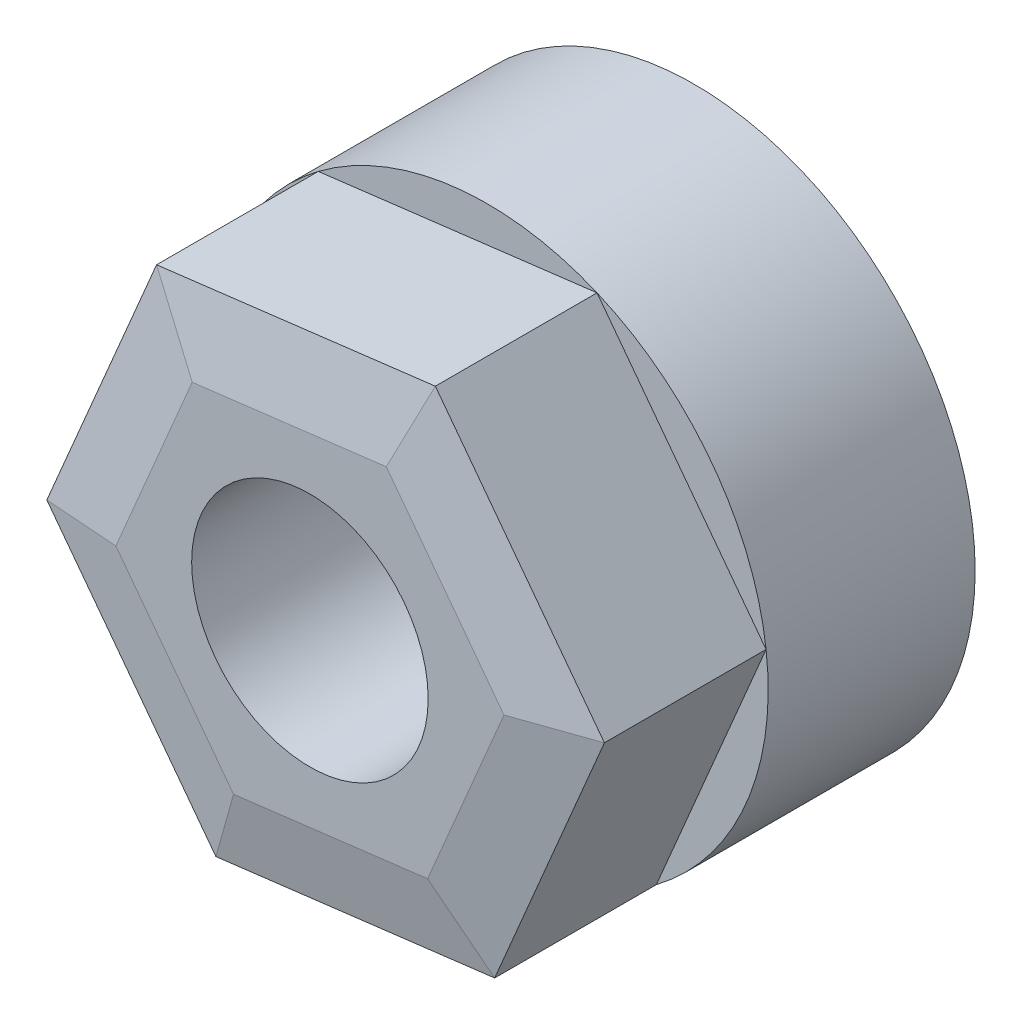
ISO-10303-21;
HEADER;
FILE_DESCRIPTION(('STEP AP214'),'2;1');
FILE_NAME('part.step','',(''),(''),'','','');
FILE_SCHEMA(('AUTOMOTIVE_DESIGN { 1 0 10303 214 1 1 1 1 }'));
ENDSEC;
DATA;
#1=APPLICATION_CONTEXT('core data for automotive mechanical design processes');
#2=APPLICATION_PROTOCOL_DEFINITION('international standard','automotive_design',2000,#1);
#3=PRODUCT_CONTEXT('',#1,'mechanical');
#4=PRODUCT('Part','Part','',(#3));
#5=PRODUCT_RELATED_PRODUCT_CATEGORY('part','',(#4));
#6=PRODUCT_DEFINITION_FORMATION('','',#4);
#7=PRODUCT_DEFINITION_CONTEXT('part definition',#1,'design');
#8=PRODUCT_DEFINITION('design','',#6,#7);
#9=PRODUCT_DEFINITION_SHAPE('','',#8);
#10=(LENGTH_UNIT() NAMED_UNIT(*) SI_UNIT(.MILLI.,.METRE.));
#11=(NAMED_UNIT(*) PLANE_ANGLE_UNIT() SI_UNIT($,.RADIAN.));
#12=(NAMED_UNIT(*) SI_UNIT($,.STERADIAN.) SOLID_ANGLE_UNIT());
#13=UNCERTAINTY_MEASURE_WITH_UNIT(LENGTH_MEASURE(1.E-05),#10,'distance_accuracy_value','');
#14=(GEOMETRIC_REPRESENTATION_CONTEXT(3) GLOBAL_UNCERTAINTY_ASSIGNED_CONTEXT((#13)) GLOBAL_UNIT_ASSIGNED_CONTEXT((#10,
#11,#12)) REPRESENTATION_CONTEXT('',''));
#15=CARTESIAN_POINT('',(0.,0.,0.));
#16=DIRECTION('',(0.,0.,1.));
#17=DIRECTION('',(1.,0.,0.));
#18=AXIS2_PLACEMENT_3D('',#15,#16,#17);
#19=CARTESIAN_POINT('',(0.,0.,7.));
#20=DIRECTION('',(0.,0.,1.));
#21=DIRECTION('',(1.,0.,0.));
#22=AXIS2_PLACEMENT_3D('',#19,#20,#21);
#23=PLANE('',#22);
#24=DIRECTION('',(-0.601855160906256,0.798605262498629,0.));
#25=VECTOR('',#24,1.);
#26=CARTESIAN_POINT('',(9.42913024104237,1.1582326611956,7.));
#27=LINE('',#26,#25);
#28=CARTESIAN_POINT('',(9.42913024104237,1.15823266119561,7.));
#29=VERTEX_POINT('',#28);
#30=CARTESIAN_POINT('',(3.71150621243294,8.74498265493258,7.));
#31=VERTEX_POINT('',#30);
#32=EDGE_CURVE('E143',#29,#31,#27,.T.);
#33=ORIENTED_EDGE('',*,*,#32,.F.);
#34=CARTESIAN_POINT('',(0.,0.,7.));
#35=DIRECTION('',(0.,0.,1.));
#36=DIRECTION('',(1.,0.,0.));
#37=AXIS2_PLACEMENT_3D('',#34,#35,#36);
#38=CIRCLE('',#37,9.5);
#39=EDGE_CURVE('E127',#29,#31,#38,.T.);
#40=ORIENTED_EDGE('',*,*,#39,.T.);
#41=EDGE_LOOP('',(#33,#40));
#42=FACE_BOUND('',#41,.T.);
#43=ADVANCED_FACE('F32',(#42),#23,.T.);
#44=DIRECTION('',(0.390684864466625,0.920524489992903,0.));
#45=VECTOR('',#44,1.);
#46=CARTESIAN_POINT('',(5.71762402860942,-7.58674999373698,7.));
#47=LINE('',#46,#45);
#48=CARTESIAN_POINT('',(5.71762402860942,-7.58674999373698,7.));
#49=VERTEX_POINT('',#48);
#50=EDGE_CURVE('E155',#49,#29,#47,.T.);
#51=ORIENTED_EDGE('',*,*,#50,.F.);
#52=EDGE_CURVE('E168',#49,#29,#38,.T.);
#53=ORIENTED_EDGE('',*,*,#52,.T.);
#54=EDGE_LOOP('',(#51,#53));
#55=FACE_BOUND('',#54,.T.);
#56=ADVANCED_FACE('F235',(#55),#23,.T.);
#57=DIRECTION('',(0.992540025372881,0.121919227494274,0.));
#58=VECTOR('',#57,1.);
#59=CARTESIAN_POINT('',(-3.71150621243293,-8.74498265493258,7.));
#60=LINE('',#59,#58);
#61=CARTESIAN_POINT('',(-3.71150621243293,-8.74498265493258,7.));
#62=VERTEX_POINT('',#61);
#63=EDGE_CURVE('E152',#62,#49,#60,.T.);
#64=ORIENTED_EDGE('',*,*,#63,.F.);
#65=EDGE_CURVE('E282',#62,#49,#38,.T.);
#66=ORIENTED_EDGE('',*,*,#65,.T.);
#67=EDGE_LOOP('',(#64,#66));
#68=FACE_BOUND('',#67,.T.);
#69=ADVANCED_FACE('F241',(#68),#23,.T.);
#70=DIRECTION('',(0.601855160906256,-0.798605262498629,0.));
#71=VECTOR('',#70,1.);
#72=CARTESIAN_POINT('',(-9.42913024104236,-1.1582326611956,7.));
#73=LINE('',#72,#71);
#74=CARTESIAN_POINT('',(-9.42913024104237,-1.15823266119562,7.));
#75=VERTEX_POINT('',#74);
#76=EDGE_CURVE('E139',#75,#62,#73,.T.);
#77=ORIENTED_EDGE('',*,*,#76,.F.);
#78=EDGE_CURVE('E136',#75,#62,#38,.T.);
#79=ORIENTED_EDGE('',*,*,#78,.T.);
#80=EDGE_LOOP('',(#77,#79));
#81=FACE_BOUND('',#80,.T.);
#82=ADVANCED_FACE('F254',(#81),#23,.T.);
#83=DIRECTION('',(-0.390684864466625,-0.920524489992903,0.));
#84=VECTOR('',#83,1.);
#85=CARTESIAN_POINT('',(-5.71762402860943,7.58674999373698,7.));
#86=LINE('',#85,#84);
#87=CARTESIAN_POINT('',(-5.71762402860943,7.58674999373698,7.));
#88=VERTEX_POINT('',#87);
#89=EDGE_CURVE('E108',#88,#75,#86,.T.);
#90=ORIENTED_EDGE('',*,*,#89,.F.);
#91=EDGE_CURVE('E128',#88,#75,#38,.T.);
#92=ORIENTED_EDGE('',*,*,#91,.T.);
#93=EDGE_LOOP('',(#90,#92));
#94=FACE_BOUND('',#93,.T.);
#95=ADVANCED_FACE('F138',(#94),#23,.T.);
#96=CARTESIAN_POINT('',(0.,0.,7.));
#97=DIRECTION('',(0.,0.,-1.));
#98=DIRECTION('',(-1.,0.,0.));
#99=AXIS2_PLACEMENT_3D('',#96,#97,#98);
#100=CYLINDRICAL_SURFACE('',#99,9.5);
#101=ORIENTED_EDGE('',*,*,#39,.F.);
#102=ORIENTED_EDGE('',*,*,#52,.F.);
#103=ORIENTED_EDGE('',*,*,#65,.F.);
#104=ORIENTED_EDGE('',*,*,#78,.F.);
#105=ORIENTED_EDGE('',*,*,#91,.F.);
#106=EDGE_CURVE('E120',#31,#88,#38,.T.);
#107=ORIENTED_EDGE('',*,*,#106,.F.);
#108=EDGE_LOOP('',(#101,#102,#103,#104,#105,#107));
#109=FACE_BOUND('',#108,.T.);
#110=CARTESIAN_POINT('',(0.,0.,0.));
#111=DIRECTION('',(0.,0.,1.));
#112=DIRECTION('',(1.,0.,0.));
#113=AXIS2_PLACEMENT_3D('',#110,#111,#112);
#114=CIRCLE('',#113,9.5);
#115=CARTESIAN_POINT('',(9.5,0.,0.));
#116=VERTEX_POINT('',#115);
#117=EDGE_CURVE('E165',#116,#116,#114,.T.);
#118=ORIENTED_EDGE('',*,*,#117,.T.);
#119=EDGE_LOOP('',(#118));
#120=FACE_BOUND('',#119,.T.);
#121=ADVANCED_FACE('F132',(#109,#120),#100,.T.);
#122=DIRECTION('',(-0.992540025372881,-0.121919227494274,0.));
#123=VECTOR('',#122,1.);
#124=CARTESIAN_POINT('',(3.71150621243294,8.74498265493258,7.));
#125=LINE('',#124,#123);
#126=EDGE_CURVE('E123',#31,#88,#125,.T.);
#127=ORIENTED_EDGE('',*,*,#126,.F.);
#128=ORIENTED_EDGE('',*,*,#106,.T.);
#129=EDGE_LOOP('',(#127,#128));
#130=FACE_BOUND('',#129,.T.);
#131=ADVANCED_FACE('F122',(#130),#23,.T.);
#132=CARTESIAN_POINT('',(0.,0.,0.));
#133=DIRECTION('',(0.,0.,1.));
#134=DIRECTION('',(1.,0.,0.));
#135=AXIS2_PLACEMENT_3D('',#132,#133,#134);
#136=PLANE('',#135);
#137=CARTESIAN_POINT('',(0.,0.,0.));
#138=DIRECTION('',(0.,0.,1.));
#139=DIRECTION('',(1.,0.,0.));
#140=AXIS2_PLACEMENT_3D('',#137,#138,#139);
#141=CIRCLE('',#140,4.);
#142=CARTESIAN_POINT('',(4.,0.,0.));
#143=VERTEX_POINT('',#142);
#144=EDGE_CURVE('E146',#143,#143,#141,.T.);
#145=ORIENTED_EDGE('',*,*,#144,.T.);
#146=EDGE_LOOP('',(#145));
#147=FACE_BOUND('',#146,.T.);
#148=ORIENTED_EDGE('',*,*,#117,.F.);
#149=EDGE_LOOP('',(#148));
#150=FACE_BOUND('',#149,.T.);
#151=ADVANCED_FACE('F218',(#147,#150),#136,.F.);
#152=CARTESIAN_POINT('',(9.42913024104237,1.1582326611956,13.));
#153=DIRECTION('',(-0.798605262498629,-0.601855160906256,0.));
#154=DIRECTION('',(0.601855160906256,-0.79860526249863,0.));
#155=AXIS2_PLACEMENT_3D('',#152,#153,#154);
#156=PLANE('',#155);
#157=DIRECTION('',(0.,0.,-1.));
#158=VECTOR('',#157,1.);
#159=CARTESIAN_POINT('',(3.71150621243294,8.74498265493258,13.));
#160=LINE('',#159,#158);
#161=CARTESIAN_POINT('',(3.71150621243294,8.74498265493258,12.4686085958249));
#162=VERTEX_POINT('',#161);
#163=EDGE_CURVE('E114',#162,#31,#160,.T.);
#164=ORIENTED_EDGE('',*,*,#163,.F.);
#165=DIRECTION('',(0.601855160906256,-0.79860526249863,0.));
#166=VECTOR('',#165,1.);
#167=CARTESIAN_POINT('',(9.42913024104237,1.1582326611956,12.4686085958249));
#168=LINE('',#167,#166);
#169=CARTESIAN_POINT('',(9.42913024104237,1.1582326611956,12.4686085958249));
#170=VERTEX_POINT('',#169);
#171=EDGE_CURVE('E185',#162,#170,#168,.T.);
#172=ORIENTED_EDGE('',*,*,#171,.T.);
#173=DIRECTION('',(0.,0.,-1.));
#174=VECTOR('',#173,1.);
#175=CARTESIAN_POINT('',(9.42913024104237,1.1582326611956,13.));
#176=LINE('',#175,#174);
#177=EDGE_CURVE('E158',#170,#29,#176,.T.);
#178=ORIENTED_EDGE('',*,*,#177,.T.);
#179=ORIENTED_EDGE('',*,*,#32,.T.);
#180=EDGE_LOOP('',(#164,#172,#178,#179));
#181=FACE_BOUND('',#180,.T.);
#182=ADVANCED_FACE('F251',(#181),#156,.F.);
#183=CARTESIAN_POINT('',(3.71150621243294,8.74498265493258,13.));
#184=DIRECTION('',(0.121919227494274,-0.992540025372881,0.));
#185=DIRECTION('',(0.992540025372881,0.121919227494274,0.));
#186=AXIS2_PLACEMENT_3D('',#183,#184,#185);
#187=PLANE('',#186);
#188=DIRECTION('',(0.,0.,-1.));
#189=VECTOR('',#188,1.);
#190=CARTESIAN_POINT('',(-5.71762402860943,7.58674999373698,13.));
#191=LINE('',#190,#189);
#192=CARTESIAN_POINT('',(-5.71762402860943,7.58674999373698,12.4686085958249));
#193=VERTEX_POINT('',#192);
#194=EDGE_CURVE('E104',#193,#88,#191,.T.);
#195=ORIENTED_EDGE('',*,*,#194,.F.);
#196=DIRECTION('',(0.992540025372881,0.121919227494274,0.));
#197=VECTOR('',#196,1.);
#198=CARTESIAN_POINT('',(3.71150621243294,8.74498265493258,12.4686085958249));
#199=LINE('',#198,#197);
#200=EDGE_CURVE('E183',#193,#162,#199,.T.);
#201=ORIENTED_EDGE('',*,*,#200,.T.);
#202=ORIENTED_EDGE('',*,*,#163,.T.);
#203=ORIENTED_EDGE('',*,*,#126,.T.);
#204=EDGE_LOOP('',(#195,#201,#202,#203));
#205=FACE_BOUND('',#204,.T.);
#206=ADVANCED_FACE('F141',(#205),#187,.F.);
#207=CARTESIAN_POINT('',(-5.71762402860943,7.58674999373698,13.));
#208=DIRECTION('',(0.920524489992903,-0.390684864466625,0.));
#209=DIRECTION('',(0.390684864466625,0.920524489992904,0.));
#210=AXIS2_PLACEMENT_3D('',#207,#208,#209);
#211=PLANE('',#210);
#212=DIRECTION('',(0.,0.,-1.));
#213=VECTOR('',#212,1.);
#214=CARTESIAN_POINT('',(-9.42913024104236,-1.1582326611956,13.));
#215=LINE('',#214,#213);
#216=CARTESIAN_POINT('',(-9.42913024104236,-1.1582326611956,12.4686085958249));
#217=VERTEX_POINT('',#216);
#218=EDGE_CURVE('E115',#217,#75,#215,.T.);
#219=ORIENTED_EDGE('',*,*,#218,.F.);
#220=DIRECTION('',(0.390684864466625,0.920524489992904,0.));
#221=VECTOR('',#220,1.);
#222=CARTESIAN_POINT('',(-5.71762402860943,7.58674999373698,12.4686085958249));
#223=LINE('',#222,#221);
#224=EDGE_CURVE('E11',#217,#193,#223,.T.);
#225=ORIENTED_EDGE('',*,*,#224,.T.);
#226=ORIENTED_EDGE('',*,*,#194,.T.);
#227=ORIENTED_EDGE('',*,*,#89,.T.);
#228=EDGE_LOOP('',(#219,#225,#226,#227));
#229=FACE_BOUND('',#228,.T.);
#230=ADVANCED_FACE('F106',(#229),#211,.F.);
#231=CARTESIAN_POINT('',(-9.42913024104236,-1.1582326611956,13.));
#232=DIRECTION('',(0.798605262498629,0.601855160906256,0.));
#233=DIRECTION('',(-0.601855160906256,0.79860526249863,0.));
#234=AXIS2_PLACEMENT_3D('',#231,#232,#233);
#235=PLANE('',#234);
#236=DIRECTION('',(0.,0.,-1.));
#237=VECTOR('',#236,1.);
#238=CARTESIAN_POINT('',(-3.71150621243293,-8.74498265493258,13.));
#239=LINE('',#238,#237);
#240=CARTESIAN_POINT('',(-3.71150621243293,-8.74498265493258,12.4686085958249));
#241=VERTEX_POINT('',#240);
#242=EDGE_CURVE('E162',#241,#62,#239,.T.);
#243=ORIENTED_EDGE('',*,*,#242,.F.);
#244=DIRECTION('',(-0.601855160906256,0.79860526249863,0.));
#245=VECTOR('',#244,1.);
#246=CARTESIAN_POINT('',(-9.42913024104236,-1.1582326611956,12.4686085958249));
#247=LINE('',#246,#245);
#248=EDGE_CURVE('E41',#241,#217,#247,.T.);
#249=ORIENTED_EDGE('',*,*,#248,.T.);
#250=ORIENTED_EDGE('',*,*,#218,.T.);
#251=ORIENTED_EDGE('',*,*,#76,.T.);
#252=EDGE_LOOP('',(#243,#249,#250,#251));
#253=FACE_BOUND('',#252,.T.);
#254=ADVANCED_FACE('F264',(#253),#235,.F.);
#255=CARTESIAN_POINT('',(-3.71150621243293,-8.74498265493258,13.));
#256=DIRECTION('',(-0.121919227494274,0.992540025372881,0.));
#257=DIRECTION('',(-0.992540025372881,-0.121919227494274,0.));
#258=AXIS2_PLACEMENT_3D('',#255,#256,#257);
#259=PLANE('',#258);
#260=DIRECTION('',(0.,0.,-1.));
#261=VECTOR('',#260,1.);
#262=CARTESIAN_POINT('',(5.71762402860942,-7.58674999373698,13.));
#263=LINE('',#262,#261);
#264=CARTESIAN_POINT('',(5.71762402860942,-7.58674999373698,12.4686085958249));
#265=VERTEX_POINT('',#264);
#266=EDGE_CURVE('E160',#265,#49,#263,.T.);
#267=ORIENTED_EDGE('',*,*,#266,.F.);
#268=DIRECTION('',(-0.992540025372881,-0.121919227494274,0.));
#269=VECTOR('',#268,1.);
#270=CARTESIAN_POINT('',(-3.71150621243293,-8.74498265493258,12.4686085958249));
#271=LINE('',#270,#269);
#272=EDGE_CURVE('E56',#265,#241,#271,.T.);
#273=ORIENTED_EDGE('',*,*,#272,.T.);
#274=ORIENTED_EDGE('',*,*,#242,.T.);
#275=ORIENTED_EDGE('',*,*,#63,.T.);
#276=EDGE_LOOP('',(#267,#273,#274,#275));
#277=FACE_BOUND('',#276,.T.);
#278=ADVANCED_FACE('F284',(#277),#259,.F.);
#279=CARTESIAN_POINT('',(5.71762402860942,-7.58674999373698,13.));
#280=DIRECTION('',(-0.920524489992903,0.390684864466625,0.));
#281=DIRECTION('',(-0.390684864466626,-0.920524489992903,0.));
#282=AXIS2_PLACEMENT_3D('',#279,#280,#281);
#283=PLANE('',#282);
#284=ORIENTED_EDGE('',*,*,#177,.F.);
#285=DIRECTION('',(-0.390684864466626,-0.920524489992903,0.));
#286=VECTOR('',#285,1.);
#287=CARTESIAN_POINT('',(5.71762402860942,-7.58674999373698,12.4686085958249));
#288=LINE('',#287,#286);
#289=EDGE_CURVE('E187',#170,#265,#288,.T.);
#290=ORIENTED_EDGE('',*,*,#289,.T.);
#291=ORIENTED_EDGE('',*,*,#266,.T.);
#292=ORIENTED_EDGE('',*,*,#50,.T.);
#293=EDGE_LOOP('',(#284,#290,#291,#292));
#294=FACE_BOUND('',#293,.T.);
#295=ADVANCED_FACE('F231',(#294),#283,.F.);
#296=CARTESIAN_POINT('',(0.,0.,13.));
#297=DIRECTION('',(0.,0.,1.));
#298=DIRECTION('',(1.,0.,0.));
#299=AXIS2_PLACEMENT_3D('',#296,#297,#298);
#300=PLANE('',#299);
#301=DIRECTION('',(-0.601855160906256,0.798605262498629,0.));
#302=VECTOR('',#301,1.);
#303=CARTESIAN_POINT('',(1.71499305618633,7.24034475266691,13.));
#304=LINE('',#303,#302);
#305=CARTESIAN_POINT('',(6.56391398688976,0.806282167129544,13.));
#306=VERTEX_POINT('',#305);
#307=CARTESIAN_POINT('',(2.58369615409232,6.0876573444673,13.));
#308=VERTEX_POINT('',#307);
#309=EDGE_CURVE('E178',#306,#308,#304,.T.);
#310=ORIENTED_EDGE('',*,*,#309,.T.);
#311=DIRECTION('',(-0.992540025372881,-0.121919227494274,0.));
#312=VECTOR('',#311,1.);
#313=CARTESIAN_POINT('',(-5.41282595987374,5.10539993030473,13.));
#314=LINE('',#313,#312);
#315=CARTESIAN_POINT('',(-3.98021783279743,5.28137517733776,13.));
#316=VERTEX_POINT('',#315);
#317=EDGE_CURVE('E180',#308,#316,#314,.T.);
#318=ORIENTED_EDGE('',*,*,#317,.T.);
#319=DIRECTION('',(-0.390684864466625,-0.920524489992903,0.));
#320=VECTOR('',#319,1.);
#321=CARTESIAN_POINT('',(-7.12781901606006,-2.13494482236218,13.));
#322=LINE('',#321,#320);
#323=CARTESIAN_POINT('',(-6.56391398688975,-0.806282167129545,13.));
#324=VERTEX_POINT('',#323);
#325=EDGE_CURVE('E167',#316,#324,#322,.T.);
#326=ORIENTED_EDGE('',*,*,#325,.T.);
#327=DIRECTION('',(0.601855160906256,-0.798605262498629,0.));
#328=VECTOR('',#327,1.);
#329=CARTESIAN_POINT('',(-1.71499305618632,-7.24034475266691,13.));
#330=LINE('',#329,#328);
#331=CARTESIAN_POINT('',(-2.58369615409232,-6.0876573444673,13.));
#332=VERTEX_POINT('',#331);
#333=EDGE_CURVE('E172',#324,#332,#330,.T.);
#334=ORIENTED_EDGE('',*,*,#333,.T.);
#335=DIRECTION('',(0.992540025372881,0.121919227494274,0.));
#336=VECTOR('',#335,1.);
#337=CARTESIAN_POINT('',(5.41282595987373,-5.10539993030473,13.));
#338=LINE('',#337,#336);
#339=CARTESIAN_POINT('',(3.98021783279743,-5.28137517733776,13.));
#340=VERTEX_POINT('',#339);
#341=EDGE_CURVE('E174',#332,#340,#338,.T.);
#342=ORIENTED_EDGE('',*,*,#341,.T.);
#343=DIRECTION('',(0.390684864466626,0.920524489992903,0.));
#344=VECTOR('',#343,1.);
#345=CARTESIAN_POINT('',(7.12781901606006,2.13494482236218,13.));
#346=LINE('',#345,#344);
#347=EDGE_CURVE('E176',#340,#306,#346,.T.);
#348=ORIENTED_EDGE('',*,*,#347,.T.);
#349=EDGE_LOOP('',(#310,#318,#326,#334,#342,#348));
#350=FACE_BOUND('',#349,.T.);
#351=CARTESIAN_POINT('',(0.,0.,13.));
#352=DIRECTION('',(0.,0.,1.));
#353=DIRECTION('',(1.,0.,0.));
#354=AXIS2_PLACEMENT_3D('',#351,#352,#353);
#355=CIRCLE('',#354,4.);
#356=CARTESIAN_POINT('',(4.,0.,13.));
#357=VERTEX_POINT('',#356);
#358=EDGE_CURVE('E206',#357,#357,#355,.T.);
#359=ORIENTED_EDGE('',*,*,#358,.F.);
#360=EDGE_LOOP('',(#359));
#361=FACE_BOUND('',#360,.T.);
#362=ADVANCED_FACE('F223',(#350,#361),#300,.T.);
#363=CARTESIAN_POINT('',(0.,0.,0.));
#364=DIRECTION('',(0.,0.,1.));
#365=DIRECTION('',(1.,0.,0.));
#366=AXIS2_PLACEMENT_3D('',#363,#364,#365);
#367=CYLINDRICAL_SURFACE('',#366,4.);
#368=ORIENTED_EDGE('',*,*,#144,.F.);
#369=EDGE_LOOP('',(#368));
#370=FACE_BOUND('',#369,.T.);
#371=ORIENTED_EDGE('',*,*,#358,.T.);
#372=EDGE_LOOP('',(#371));
#373=FACE_BOUND('',#372,.T.);
#374=ADVANCED_FACE('F221',(#370,#373),#367,.F.);
#375=CARTESIAN_POINT('',(0.698260839352554,-5.68451626090253,13.));
#376=DIRECTION('',(0.0253484327315291,-0.206360674879574,0.978147600733806));
#377=DIRECTION('',(-0.992540025372881,-0.121919227494274,0.));
#378=AXIS2_PLACEMENT_3D('',#375,#376,#377);
#379=PLANE('',#378);
#380=DIRECTION('',(0.384229250222659,0.90531389047907,0.181037683864391));
#381=VECTOR('',#380,1.);
#382=CARTESIAN_POINT('',(-1.95894204532337,-4.6156232073613,13.2943660243741));
#383=LINE('',#382,#381);
#384=EDGE_CURVE('E200',#241,#332,#383,.T.);
#385=ORIENTED_EDGE('',*,*,#384,.F.);
#386=ORIENTED_EDGE('',*,*,#272,.F.);
#387=DIRECTION('',(-0.591910202442468,0.785409236809406,0.181037683864391));
#388=VECTOR('',#387,1.);
#389=CARTESIAN_POINT('',(3.0177759292102,-4.00430517947215,13.2943660243741));
#390=LINE('',#389,#388);
#391=EDGE_CURVE('E36',#340,#265,#390,.F.);
#392=ORIENTED_EDGE('',*,*,#391,.F.);
#393=ORIENTED_EDGE('',*,*,#341,.F.);
#394=EDGE_LOOP('',(#385,#386,#392,#393));
#395=FACE_BOUND('',#394,.T.);
#396=ADVANCED_FACE('F34',(#395),#379,.T.);
#397=CARTESIAN_POINT('',(5.27206590984359,-2.23754650510411,13.));
#398=DIRECTION('',(0.191387803153577,-0.081227950748162,0.978147600733806));
#399=DIRECTION('',(-0.390684864466626,-0.920524489992903,0.));
#400=AXIS2_PLACEMENT_3D('',#397,#398,#399);
#401=PLANE('',#400);
#402=ORIENTED_EDGE('',*,*,#391,.T.);
#403=ORIENTED_EDGE('',*,*,#289,.F.);
#404=DIRECTION('',(-0.976139452665128,-0.119904653669665,0.181037683864391));
#405=VECTOR('',#404,1.);
#406=CARTESIAN_POINT('',(4.97671797453358,0.611318027889155,13.2943660243741));
#407=LINE('',#406,#405);
#408=EDGE_CURVE('E198',#306,#170,#407,.F.);
#409=ORIENTED_EDGE('',*,*,#408,.F.);
#410=ORIENTED_EDGE('',*,*,#347,.F.);
#411=EDGE_LOOP('',(#402,#403,#409,#410));
#412=FACE_BOUND('',#411,.T.);
#413=ADVANCED_FACE('F229',(#412),#401,.T.);
#414=CARTESIAN_POINT('',(-4.57380507049104,-3.44696975579842,13.));
#415=DIRECTION('',(-0.166039370422048,-0.125132724131412,0.978147600733806));
#416=DIRECTION('',(-0.601855160906256,0.79860526249863,0.));
#417=AXIS2_PLACEMENT_3D('',#414,#415,#416);
#418=PLANE('',#417);
#419=ORIENTED_EDGE('',*,*,#384,.T.);
#420=ORIENTED_EDGE('',*,*,#333,.F.);
#421=DIRECTION('',(0.976139452665127,0.119904653669665,0.181037683864391));
#422=VECTOR('',#421,1.);
#423=CARTESIAN_POINT('',(-4.97671797453358,-0.611318027889155,13.2943660243741));
#424=LINE('',#423,#422);
#425=EDGE_CURVE('E195',#217,#324,#424,.T.);
#426=ORIENTED_EDGE('',*,*,#425,.F.);
#427=ORIENTED_EDGE('',*,*,#248,.F.);
#428=EDGE_LOOP('',(#419,#420,#426,#427));
#429=FACE_BOUND('',#428,.T.);
#430=ADVANCED_FACE('F266',(#429),#418,.T.);
#431=CARTESIAN_POINT('',(4.57380507049104,3.44696975579842,13.));
#432=DIRECTION('',(0.166039370422048,0.125132724131412,0.978147600733806));
#433=DIRECTION('',(0.601855160906256,-0.79860526249863,0.));
#434=AXIS2_PLACEMENT_3D('',#431,#432,#433);
#435=PLANE('',#434);
#436=ORIENTED_EDGE('',*,*,#408,.T.);
#437=ORIENTED_EDGE('',*,*,#171,.F.);
#438=DIRECTION('',(-0.38422925022266,-0.90531389047907,0.181037683864391));
#439=VECTOR('',#438,1.);
#440=CARTESIAN_POINT('',(1.95894204532338,4.6156232073613,13.2943660243741));
#441=LINE('',#440,#439);
#442=EDGE_CURVE('E193',#308,#162,#441,.F.);
#443=ORIENTED_EDGE('',*,*,#442,.F.);
#444=ORIENTED_EDGE('',*,*,#309,.F.);
#445=EDGE_LOOP('',(#436,#437,#443,#444));
#446=FACE_BOUND('',#445,.T.);
#447=ADVANCED_FACE('F291',(#446),#435,.T.);
#448=CARTESIAN_POINT('',(-5.27206590984359,2.2375465051041,13.));
#449=DIRECTION('',(-0.191387803153577,0.0812279507481619,0.978147600733806));
#450=DIRECTION('',(0.390684864466625,0.920524489992904,0.));
#451=AXIS2_PLACEMENT_3D('',#448,#449,#450);
#452=PLANE('',#451);
#453=ORIENTED_EDGE('',*,*,#425,.T.);
#454=ORIENTED_EDGE('',*,*,#325,.F.);
#455=DIRECTION('',(-0.591910202442469,0.785409236809405,-0.181037683864391));
#456=VECTOR('',#455,1.);
#457=CARTESIAN_POINT('',(-3.0177759292102,4.00430517947214,13.2943660243741));
#458=LINE('',#457,#456);
#459=EDGE_CURVE('E191',#193,#316,#458,.F.);
#460=ORIENTED_EDGE('',*,*,#459,.F.);
#461=ORIENTED_EDGE('',*,*,#224,.F.);
#462=EDGE_LOOP('',(#453,#454,#460,#461));
#463=FACE_BOUND('',#462,.T.);
#464=ADVANCED_FACE('F270',(#463),#452,.T.);
#465=CARTESIAN_POINT('',(-0.698260839352553,5.68451626090253,13.));
#466=DIRECTION('',(-0.0253484327315291,0.206360674879574,0.978147600733806));
#467=DIRECTION('',(0.992540025372881,0.121919227494274,0.));
#468=AXIS2_PLACEMENT_3D('',#465,#466,#467);
#469=PLANE('',#468);
#470=ORIENTED_EDGE('',*,*,#442,.T.);
#471=ORIENTED_EDGE('',*,*,#200,.F.);
#472=ORIENTED_EDGE('',*,*,#459,.T.);
#473=ORIENTED_EDGE('',*,*,#317,.F.);
#474=EDGE_LOOP('',(#470,#471,#472,#473));
#475=FACE_BOUND('',#474,.T.);
#476=ADVANCED_FACE('F273',(#475),#469,.T.);
#477=CLOSED_SHELL('',(#43,#56,#69,#82,#95,#121,#131,#151,#182,#206,#230,#254,#278,#295,#362,
#374,#396,#413,#430,#447,#464,#476));
#478=MANIFOLD_SOLID_BREP('B2',#477);
#479=ADVANCED_BREP_SHAPE_REPRESENTATION('',(#18,#478),#14);
#480=SHAPE_DEFINITION_REPRESENTATION(#9,#479);
ENDSEC;
END-ISO-10303-21;
